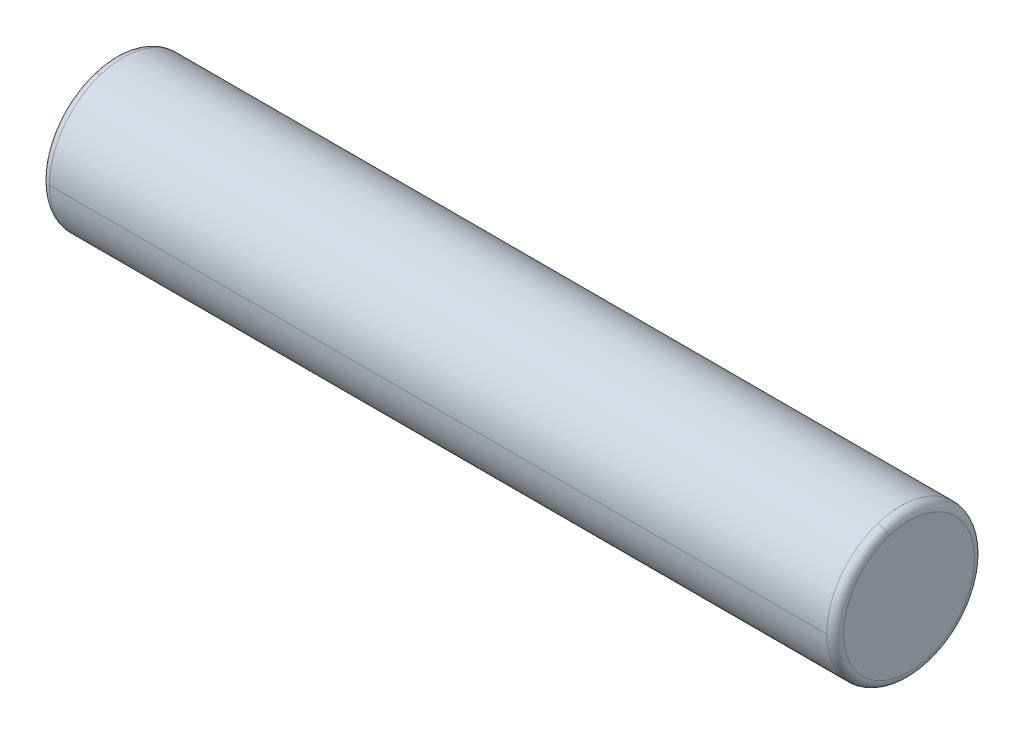
ISO-10303-21;
HEADER;
FILE_DESCRIPTION(('STEP AP214'),'2;1');
FILE_NAME('part.step','',(''),(''),'','','');
FILE_SCHEMA(('AUTOMOTIVE_DESIGN { 1 0 10303 214 1 1 1 1 }'));
ENDSEC;
DATA;
#1=APPLICATION_CONTEXT('core data for automotive mechanical design processes');
#2=APPLICATION_PROTOCOL_DEFINITION('international standard','automotive_design',2000,#1);
#3=PRODUCT_CONTEXT('',#1,'mechanical');
#4=PRODUCT('Part','Part','',(#3));
#5=PRODUCT_RELATED_PRODUCT_CATEGORY('part','',(#4));
#6=PRODUCT_DEFINITION_FORMATION('','',#4);
#7=PRODUCT_DEFINITION_CONTEXT('part definition',#1,'design');
#8=PRODUCT_DEFINITION('design','',#6,#7);
#9=PRODUCT_DEFINITION_SHAPE('','',#8);
#10=(LENGTH_UNIT() NAMED_UNIT(*) SI_UNIT(.MILLI.,.METRE.));
#11=(NAMED_UNIT(*) PLANE_ANGLE_UNIT() SI_UNIT($,.RADIAN.));
#12=(NAMED_UNIT(*) SI_UNIT($,.STERADIAN.) SOLID_ANGLE_UNIT());
#13=UNCERTAINTY_MEASURE_WITH_UNIT(LENGTH_MEASURE(1.E-05),#10,'distance_accuracy_value','');
#14=(GEOMETRIC_REPRESENTATION_CONTEXT(3) GLOBAL_UNCERTAINTY_ASSIGNED_CONTEXT((#13)) GLOBAL_UNIT_ASSIGNED_CONTEXT((#10,
#11,#12)) REPRESENTATION_CONTEXT('',''));
#15=CARTESIAN_POINT('',(0.,0.,0.));
#16=DIRECTION('',(0.,0.,1.));
#17=DIRECTION('',(1.,0.,0.));
#18=AXIS2_PLACEMENT_3D('',#15,#16,#17);
#19=CARTESIAN_POINT('',(3.1,29.25,0.));
#20=DIRECTION('',(1.,0.,0.));
#21=DIRECTION('',(0.,0.,-1.));
#22=AXIS2_PLACEMENT_3D('',#19,#20,#21);
#23=PLANE('',#22);
#24=CARTESIAN_POINT('',(3.1,30.724137600257,0.478976341281001));
#25=CARTESIAN_POINT('',(3.1,30.7163008719419,0.503097051966079));
#26=CARTESIAN_POINT('',(3.1,30.7078711460442,0.527025037923453));
#27=CARTESIAN_POINT('',(3.1,30.6898482176225,0.574438756045452));
#28=CARTESIAN_POINT('',(3.1,30.6802550150986,0.597924488210076));
#29=CARTESIAN_POINT('',(3.1,30.6599276519636,0.644396894409227));
#30=CARTESIAN_POINT('',(3.1,30.6491934913525,0.667383568443754));
#31=CARTESIAN_POINT('',(3.1,30.6266102302895,0.712802541800716));
#32=CARTESIAN_POINT('',(3.1,30.6147611298377,0.735234841123151));
#33=CARTESIAN_POINT('',(3.1,30.589976492087,0.779491007516879));
#34=CARTESIAN_POINT('',(3.1,30.5770409547882,0.801314874588172));
#35=CARTESIAN_POINT('',(3.1,30.550114617581,0.844301605203733));
#36=CARTESIAN_POINT('',(3.1,30.5361238176727,0.865464468748));
#37=CARTESIAN_POINT('',(3.1,30.5071206572556,0.907078207956979));
#38=CARTESIAN_POINT('',(3.1,30.4921082967468,0.92752908362169));
#39=CARTESIAN_POINT('',(3.1,30.4610981820384,0.967669579431778));
#40=CARTESIAN_POINT('',(3.1,30.4451004278388,0.987359199577156));
#41=CARTESIAN_POINT('',(3.1,30.4121580655205,1.02592975024571));
#42=CARTESIAN_POINT('',(3.1,30.3952134574019,1.04481068076889));
#43=CARTESIAN_POINT('',(3.1,30.3604182083495,1.08171836639997));
#44=CARTESIAN_POINT('',(3.1,30.3425675674158,1.09974512150787));
#45=CARTESIAN_POINT('',(3.1,30.306003256475,1.1349010282704));
#46=CARTESIAN_POINT('',(3.1,30.2872895864679,1.15203017992503));
#47=CARTESIAN_POINT('',(3.1,30.2490443002548,1.18534961415595));
#48=CARTESIAN_POINT('',(3.1,30.2295126840488,1.20153989673224));
#49=CARTESIAN_POINT('',(3.1,30.189678558811,1.23294258899722));
#50=CARTESIAN_POINT('',(3.1,30.1693760497791,1.24815499868591));
#51=CARTESIAN_POINT('',(3.1,30.1280490494124,1.27756529714842));
#52=CARTESIAN_POINT('',(3.1,30.1070245580776,1.29176318592224));
#53=CARTESIAN_POINT('',(3.1,30.0643042429459,1.31911023859733));
#54=CARTESIAN_POINT('',(3.1,30.0426084191492,1.33225940249861));
#55=CARTESIAN_POINT('',(3.1,29.9985977062335,1.35747732794104));
#56=CARTESIAN_POINT('',(3.1,29.9762828171147,1.36954608948221));
#57=CARTESIAN_POINT('',(3.1,29.9310877320774,1.39257413550077));
#58=CARTESIAN_POINT('',(3.1,29.908207536159,1.40353341997817));
#59=CARTESIAN_POINT('',(3.1,29.8619369579185,1.42431610999299));
#60=CARTESIAN_POINT('',(3.1,29.8385465755964,1.4341395155304));
#61=CARTESIAN_POINT('',(3.1,29.7913119740285,1.45262678222088));
#62=CARTESIAN_POINT('',(3.1,29.7674677547827,1.46129064337394));
#63=CARTESIAN_POINT('',(3.1,29.7193829221799,1.47743794929532));
#64=CARTESIAN_POINT('',(3.1,29.6951423088229,1.48492139406364));
#65=CARTESIAN_POINT('',(3.1,29.6463230857586,1.49868983894163));
#66=CARTESIAN_POINT('',(3.1,29.6217444760512,1.50497483905129));
#67=CARTESIAN_POINT('',(3.1,29.5723084723099,1.5163312534962));
#68=CARTESIAN_POINT('',(3.1,29.5474510782758,1.52140266783144));
#69=CARTESIAN_POINT('',(3.1,29.4975173895205,1.53031969324616));
#70=CARTESIAN_POINT('',(3.1,29.4724410947992,1.53416530432564));
#71=CARTESIAN_POINT('',(3.1,29.4221300156598,1.54062145881492));
#72=CARTESIAN_POINT('',(3.1,29.3968952312417,1.54323200222472));
#73=CARTESIAN_POINT('',(3.1,29.3463279655146,1.5472117323469));
#74=CARTESIAN_POINT('',(3.1,29.3209954842056,1.54858091905928));
#75=CARTESIAN_POINT('',(3.1,29.2702938528631,1.55007463729591));
#76=CARTESIAN_POINT('',(3.1,29.2449247028296,1.55019916882015));
#77=CARTESIAN_POINT('',(3.1,29.1942108505425,1.54920327667317));
#78=CARTESIAN_POINT('',(3.1,29.168866148289,1.54808285300193));
#79=CARTESIAN_POINT('',(3.1,29.1182622491695,1.54459974966274));
#80=CARTESIAN_POINT('',(3.1,29.0930030523037,1.54223706999478));
#81=CARTESIAN_POINT('',(3.1,29.0426310155772,1.53627514656442));
#82=CARTESIAN_POINT('',(3.1,29.0175181757166,1.532675902802));
#83=CARTESIAN_POINT('',(3.1,28.9674993520317,1.52424952207621));
#84=CARTESIAN_POINT('',(3.1,28.9425933682073,1.51942238511282));
#85=CARTESIAN_POINT('',(3.1,28.8930482572913,1.50855184698083));
#86=CARTESIAN_POINT('',(3.1,28.8684091301996,1.50250844581222));
#87=CARTESIAN_POINT('',(3.1,28.8194570905643,1.48921993835254));
#88=CARTESIAN_POINT('',(3.1,28.7951441780207,1.48197483206146));
#89=CARTESIAN_POINT('',(3.1,28.7469031394173,1.46630036845249));
#90=CARTESIAN_POINT('',(3.1,28.7229750133576,1.4578710111346));
#91=CARTESIAN_POINT('',(3.1,28.6755611926735,1.4398483525321));
#92=CARTESIAN_POINT('',(3.1,28.6520754980492,1.43025505124749));
#93=CARTESIAN_POINT('',(3.1,28.6056031193315,1.40992761581464));
#94=CARTESIAN_POINT('',(3.1,28.5826164352381,1.39919348166639));
#95=CARTESIAN_POINT('',(3.1,28.5371974545175,1.37661023997561));
#96=CARTESIAN_POINT('',(3.1,28.5147651578903,1.36476113243307));
#97=CARTESIAN_POINT('',(3.1,28.4705089934697,1.33997648949166));
#98=CARTESIAN_POINT('',(3.1,28.4486851256762,1.32704095409277));
#99=CARTESIAN_POINT('',(3.1,28.4056983945319,1.30011461827644));
#100=CARTESIAN_POINT('',(3.1,28.3845355311812,1.286123817859));
#101=CARTESIAN_POINT('',(3.1,28.3429217921139,1.25712065706921));
#102=CARTESIAN_POINT('',(3.1,28.3224709163973,1.24210829669686));
#103=CARTESIAN_POINT('',(3.1,28.2823304205492,1.21109818208833));
#104=CARTESIAN_POINT('',(3.1,28.2626408004178,1.19510042785215));
#105=CARTESIAN_POINT('',(3.1,28.2240702497594,1.16215806550713));
#106=CARTESIAN_POINT('',(3.1,28.2051893192325,1.1452134573983));
#107=CARTESIAN_POINT('',(3.1,28.1682816335987,1.1104182083531));
#108=CARTESIAN_POINT('',(3.1,28.1502548784918,1.09256756741673));
#109=CARTESIAN_POINT('',(3.1,28.11509897173,1.056003256474));
#110=CARTESIAN_POINT('',(3.1,28.0979698200751,1.03728958646764));
#111=CARTESIAN_POINT('',(3.1,28.064650385844,0.999044300255088));
#112=CARTESIAN_POINT('',(3.1,28.0484601032677,0.979512684048904));
#113=CARTESIAN_POINT('',(3.1,28.0170574110028,0.939678558810919));
#114=CARTESIAN_POINT('',(3.1,28.0018450013141,0.919376049779119));
#115=CARTESIAN_POINT('',(3.1,27.9724347028516,0.878049049412452));
#116=CARTESIAN_POINT('',(3.1,27.9582368140778,0.857024558077586));
#117=CARTESIAN_POINT('',(3.1,27.9308897614027,0.814304242945939));
#118=CARTESIAN_POINT('',(3.1,27.9177405975014,0.792608419149159));
#119=CARTESIAN_POINT('',(3.1,27.892522672059,0.748597706233541));
#120=CARTESIAN_POINT('',(3.1,27.8804539105178,0.726282817114703));
#121=CARTESIAN_POINT('',(3.1,27.8574258644992,0.68108773207741));
#122=CARTESIAN_POINT('',(3.1,27.8464665800218,0.658207536158955));
#123=CARTESIAN_POINT('',(3.1,27.825683890007,0.611936957918464));
#124=CARTESIAN_POINT('',(3.1,27.8158604844696,0.588546575596428));
#125=CARTESIAN_POINT('',(3.1,27.7973732177791,0.541311974028549));
#126=CARTESIAN_POINT('',(3.1,27.7887093566261,0.517467754782707));
#127=CARTESIAN_POINT('',(3.1,27.7725620507047,0.469382922179862));
#128=CARTESIAN_POINT('',(3.1,27.7650786059363,0.44514230882286));
#129=CARTESIAN_POINT('',(3.1,27.7513101610584,0.396323085758586));
#130=CARTESIAN_POINT('',(3.1,27.745025160949,0.371744476051314));
#131=CARTESIAN_POINT('',(3.1,27.7336687465035,0.322308472309799));
#132=CARTESIAN_POINT('',(3.1,27.7285973321676,0.297451078275557));
#133=CARTESIAN_POINT('',(3.1,27.7196803067548,0.247517389520762));
#134=CARTESIAN_POINT('',(3.1,27.7158346956781,0.222441094800211));
#135=CARTESIAN_POINT('',(3.1,27.7093785411814,0.172130015658794));
#136=CARTESIAN_POINT('',(3.1,27.7067679977615,0.146895231237927));
#137=CARTESIAN_POINT('',(3.1,27.7027882676669,0.0963279655183182));
#138=CARTESIAN_POINT('',(3.1,27.7014190809923,0.0709954842195761));
#139=CARTESIAN_POINT('',(3.1,27.6999253626525,0.0202938528490886));
#140=CARTESIAN_POINT('',(3.1,27.6998008309875,-0.00507529722265686));
#141=CARTESIAN_POINT('',(3.1,27.7007967235192,-0.0557891494052583));
#142=CARTESIAN_POINT('',(3.1,27.7019171477161,-0.0811338515161143));
#143=CARTESIAN_POINT('',(3.1,27.7054002496193,-0.131737751025358));
#144=CARTESIAN_POINT('',(3.1,27.7077629273256,-0.156996948423746));
#145=CARTESIAN_POINT('',(3.1,27.7137248561152,-0.207368983695411));
#146=CARTESIAN_POINT('',(3.1,27.7173241071983,-0.232481821568688));
#147=CARTESIAN_POINT('',(3.1,27.7257504679235,-0.282500650682992));
#148=CARTESIAN_POINT('',(3.1,27.7305775775655,-0.30740664192402));
#149=CARTESIAN_POINT('',(3.1,27.7414481903408,-0.356951732577393));
#150=CARTESIAN_POINT('',(3.1,27.7474916934742,-0.381590831989738));
#151=CARTESIAN_POINT('',(3.1,27.7607799223611,-0.430542947246312));
#152=CARTESIAN_POINT('',(3.1,27.7680246481147,-0.454855963090541));
#153=CARTESIAN_POINT('',(3.1,27.775862399743,-0.478976341280996));
#154=B_SPLINE_CURVE_WITH_KNOTS('',3,(#24,#25,#26,#27,#28,#29,#30,#31,#32,#33,#34,#35,#36,#37,
#38,#39,#40,#41,#42,#43,#44,#45,#46,#47,#48,#49,#50,#51,#52,#53,#54,#55,#56,#57,#58,#59,#60,#61,
#62,#63,#64,#65,#66,#67,#68,#69,#70,#71,#72,#73,#74,#75,#76,#77,#78,#79,#80,#81,#82,#83,#84,#85,
#86,#87,#88,#89,#90,#91,#92,#93,#94,#95,#96,#97,#98,#99,#100,#101,#102,#103,#104,#105,#106,#107,
#108,#109,#110,#111,#112,#113,#114,#115,#116,#117,#118,#119,#120,#121,#122,#123,#124,#125,#126,
#127,#128,#129,#130,#131,#132,#133,#134,#135,#136,#137,#138,#139,#140,#141,#142,#143,#144,#145,
#146,#147,#148,#149,#150,#151,#152,#153),.UNSPECIFIED.,.F.,.F.,(4,2,2,2,2,2,2,2,2,2,2,2,2,2,2,2,
2,2,2,2,2,2,2,2,2,2,2,2,2,2,2,2,2,2,2,2,2,2,2,2,2,2,2,2,2,2,2,2,2,2,2,2,2,2,2,2,2,2,2,2,2,2,2,2,
4),(0.,0.0760778084210016,0.152155616842003,0.228233425263003,0.304311233684006,
0.380389042105006,0.456466850526008,0.53254465894701,0.608622467368011,0.684700275789012,
0.760778084210015,0.836855892631017,0.912933701052018,0.989011509473018,1.06508931789402,
1.14116712631502,1.21724493473602,1.29332274315702,1.36940055157803,1.44547835999903,
1.52155616842003,1.59763397684103,1.67371178526203,1.74978959368303,1.82586740210404,
1.90194521052504,1.97802301894604,2.05410082736704,2.13017863578804,2.20625644420904,
2.28233425263004,2.35841206105104,2.43448986947205,2.51056767789305,2.58664548631405,
2.66272329473505,2.73880110315605,2.81487891157705,2.89095671999805,2.96703452841906,
3.04311233684006,3.11919014526106,3.19526795368206,3.27134576210306,3.34742357052406,
3.42350137894507,3.49957918736607,3.57565699578707,3.65173480420807,3.72781261262907,
3.80389042105007,3.87996822947107,3.95604603789208,4.03212384631308,4.10820165473408,
4.18427946315508,4.26035727157608,4.33643507999708,4.41251288841808,4.48859069683909,
4.56466850526009,4.64074631368109,4.71682412210209,4.79290193052309,4.86897973894409),.UNSPECIFIED.);
#155=CARTESIAN_POINT('',(3.1,30.724137600257,0.478976341281001));
#156=VERTEX_POINT('',#155);
#157=CARTESIAN_POINT('',(3.1,27.775862399743,-0.478976341281001));
#158=VERTEX_POINT('',#157);
#159=EDGE_CURVE('E11',#156,#158,#154,.T.);
#160=ORIENTED_EDGE('',*,*,#159,.F.);
#161=CARTESIAN_POINT('',(3.1,27.775862399743,-0.478976341281001));
#162=CARTESIAN_POINT('',(3.1,27.7836991280581,-0.503097051966078));
#163=CARTESIAN_POINT('',(3.1,27.7921288539558,-0.527025037923453));
#164=CARTESIAN_POINT('',(3.1,27.8101517823775,-0.574438756045452));
#165=CARTESIAN_POINT('',(3.1,27.8197449849014,-0.597924488210076));
#166=CARTESIAN_POINT('',(3.1,27.8400723480365,-0.644396894409227));
#167=CARTESIAN_POINT('',(3.1,27.8508065086475,-0.667383568443754));
#168=CARTESIAN_POINT('',(3.1,27.8733897697105,-0.712802541800716));
#169=CARTESIAN_POINT('',(3.1,27.8852388701623,-0.735234841123151));
#170=CARTESIAN_POINT('',(3.1,27.910023507913,-0.779491007516879));
#171=CARTESIAN_POINT('',(3.1,27.9229590452118,-0.801314874588172));
#172=CARTESIAN_POINT('',(3.1,27.949885382419,-0.844301605203732));
#173=CARTESIAN_POINT('',(3.1,27.9638761823273,-0.865464468748));
#174=CARTESIAN_POINT('',(3.1,27.9928793427445,-0.907078207956979));
#175=CARTESIAN_POINT('',(3.1,28.0078917032532,-0.92752908362169));
#176=CARTESIAN_POINT('',(3.1,28.0389018179616,-0.967669579431778));
#177=CARTESIAN_POINT('',(3.1,28.0548995721612,-0.987359199577155));
#178=CARTESIAN_POINT('',(3.1,28.0878419344795,-1.02592975024571));
#179=CARTESIAN_POINT('',(3.1,28.1047865425981,-1.04481068076889));
#180=CARTESIAN_POINT('',(3.1,28.1395817916505,-1.08171836639997));
#181=CARTESIAN_POINT('',(3.1,28.1574324325842,-1.09974512150787));
#182=CARTESIAN_POINT('',(3.1,28.193996743525,-1.1349010282704));
#183=CARTESIAN_POINT('',(3.1,28.2127104135321,-1.15203017992503));
#184=CARTESIAN_POINT('',(3.1,28.2509556997452,-1.18534961415595));
#185=CARTESIAN_POINT('',(3.1,28.2704873159512,-1.20153989673224));
#186=CARTESIAN_POINT('',(3.1,28.310321441189,-1.23294258899722));
#187=CARTESIAN_POINT('',(3.1,28.3306239502209,-1.24815499868591));
#188=CARTESIAN_POINT('',(3.1,28.3719509505876,-1.27756529714842));
#189=CARTESIAN_POINT('',(3.1,28.3929754419224,-1.29176318592224));
#190=CARTESIAN_POINT('',(3.1,28.4356957570541,-1.31911023859733));
#191=CARTESIAN_POINT('',(3.1,28.4573915808508,-1.33225940249861));
#192=CARTESIAN_POINT('',(3.1,28.5014022937665,-1.35747732794104));
#193=CARTESIAN_POINT('',(3.1,28.5237171828853,-1.3695460894822));
#194=CARTESIAN_POINT('',(3.1,28.5689122679226,-1.39257413550077));
#195=CARTESIAN_POINT('',(3.1,28.591792463841,-1.40353341997817));
#196=CARTESIAN_POINT('',(3.1,28.6380630420815,-1.42431610999299));
#197=CARTESIAN_POINT('',(3.1,28.6614534244036,-1.4341395155304));
#198=CARTESIAN_POINT('',(3.1,28.7086880259715,-1.45262678222088));
#199=CARTESIAN_POINT('',(3.1,28.7325322452173,-1.46129064337394));
#200=CARTESIAN_POINT('',(3.1,28.7806170778201,-1.47743794929532));
#201=CARTESIAN_POINT('',(3.1,28.8048576911771,-1.48492139406364));
#202=CARTESIAN_POINT('',(3.1,28.8536769142414,-1.49868983894162));
#203=CARTESIAN_POINT('',(3.1,28.8782555239488,-1.50497483905129));
#204=CARTESIAN_POINT('',(3.1,28.9276915276901,-1.5163312534962));
#205=CARTESIAN_POINT('',(3.1,28.9525489217242,-1.52140266783144));
#206=CARTESIAN_POINT('',(3.1,29.0024826104795,-1.53031969324616));
#207=CARTESIAN_POINT('',(3.1,29.0275589052008,-1.53416530432564));
#208=CARTESIAN_POINT('',(3.1,29.0778699843402,-1.54062145881492));
#209=CARTESIAN_POINT('',(3.1,29.1031047687583,-1.54323200222472));
#210=CARTESIAN_POINT('',(3.1,29.1536720344854,-1.5472117323469));
#211=CARTESIAN_POINT('',(3.1,29.1790045157944,-1.54858091905928));
#212=CARTESIAN_POINT('',(3.1,29.2297061471369,-1.55007463729591));
#213=CARTESIAN_POINT('',(3.1,29.2550752971704,-1.55019916882015));
#214=CARTESIAN_POINT('',(3.1,29.3057891494575,-1.54920327667317));
#215=CARTESIAN_POINT('',(3.1,29.331133851711,-1.54808285300193));
#216=CARTESIAN_POINT('',(3.1,29.3817377508305,-1.54459974966274));
#217=CARTESIAN_POINT('',(3.1,29.4069969476964,-1.54223706999478));
#218=CARTESIAN_POINT('',(3.1,29.4573689844228,-1.53627514656442));
#219=CARTESIAN_POINT('',(3.1,29.4824818242834,-1.532675902802));
#220=CARTESIAN_POINT('',(3.1,29.5325006479683,-1.52424952207621));
#221=CARTESIAN_POINT('',(3.1,29.5574066317927,-1.51942238511282));
#222=CARTESIAN_POINT('',(3.1,29.6069517427087,-1.50855184698083));
#223=CARTESIAN_POINT('',(3.1,29.6315908698004,-1.50250844581222));
#224=CARTESIAN_POINT('',(3.1,29.6805429094357,-1.48921993835254));
#225=CARTESIAN_POINT('',(3.1,29.7048558219793,-1.48197483206146));
#226=CARTESIAN_POINT('',(3.1,29.7530968605827,-1.46630036845249));
#227=CARTESIAN_POINT('',(3.1,29.7770249866424,-1.4578710111346));
#228=CARTESIAN_POINT('',(3.1,29.8244388073265,-1.4398483525321));
#229=CARTESIAN_POINT('',(3.1,29.8479245019508,-1.43025505124749));
#230=CARTESIAN_POINT('',(3.1,29.8943968806685,-1.40992761581464));
#231=CARTESIAN_POINT('',(3.1,29.9173835647619,-1.39919348166639));
#232=CARTESIAN_POINT('',(3.1,29.9628025454825,-1.37661023997561));
#233=CARTESIAN_POINT('',(3.1,29.9852348421097,-1.36476113243307));
#234=CARTESIAN_POINT('',(3.1,30.0294910065303,-1.33997648949166));
#235=CARTESIAN_POINT('',(3.1,30.0513148743238,-1.32704095409277));
#236=CARTESIAN_POINT('',(3.1,30.0943016054681,-1.30011461827644));
#237=CARTESIAN_POINT('',(3.1,30.1154644688188,-1.286123817859));
#238=CARTESIAN_POINT('',(3.1,30.1570782078861,-1.25712065706921));
#239=CARTESIAN_POINT('',(3.1,30.1775290836027,-1.24210829669686));
#240=CARTESIAN_POINT('',(3.1,30.2176695794508,-1.21109818208833));
#241=CARTESIAN_POINT('',(3.1,30.2373591995822,-1.19510042785215));
#242=CARTESIAN_POINT('',(3.1,30.2759297502406,-1.16215806550713));
#243=CARTESIAN_POINT('',(3.1,30.2948106807675,-1.1452134573983));
#244=CARTESIAN_POINT('',(3.1,30.3317183664013,-1.1104182083531));
#245=CARTESIAN_POINT('',(3.1,30.3497451215082,-1.09256756741673));
#246=CARTESIAN_POINT('',(3.1,30.38490102827,-1.056003256474));
#247=CARTESIAN_POINT('',(3.1,30.4020301799249,-1.03728958646764));
#248=CARTESIAN_POINT('',(3.1,30.435349614156,-0.99904430025509));
#249=CARTESIAN_POINT('',(3.1,30.4515398967323,-0.979512684048905));
#250=CARTESIAN_POINT('',(3.1,30.4829425889972,-0.93967855881092));
#251=CARTESIAN_POINT('',(3.1,30.4981549986859,-0.919376049779121));
#252=CARTESIAN_POINT('',(3.1,30.5275652971484,-0.878049049412455));
#253=CARTESIAN_POINT('',(3.1,30.5417631859222,-0.857024558077588));
#254=CARTESIAN_POINT('',(3.1,30.5691102385973,-0.814304242945941));
#255=CARTESIAN_POINT('',(3.1,30.5822594024986,-0.792608419149161));
#256=CARTESIAN_POINT('',(3.1,30.607477327941,-0.748597706233543));
#257=CARTESIAN_POINT('',(3.1,30.6195460894822,-0.726282817114704));
#258=CARTESIAN_POINT('',(3.1,30.6425741355008,-0.681087732077411));
#259=CARTESIAN_POINT('',(3.1,30.6535334199782,-0.658207536158957));
#260=CARTESIAN_POINT('',(3.1,30.674316109993,-0.611936957918467));
#261=CARTESIAN_POINT('',(3.1,30.6841395155304,-0.58854657559643));
#262=CARTESIAN_POINT('',(3.1,30.7026267822209,-0.541311974028552));
#263=CARTESIAN_POINT('',(3.1,30.7112906433739,-0.517467754782709));
#264=CARTESIAN_POINT('',(3.1,30.7274379492953,-0.469382922179864));
#265=CARTESIAN_POINT('',(3.1,30.7349213940637,-0.445142308822862));
#266=CARTESIAN_POINT('',(3.1,30.7486898389416,-0.396323085758588));
#267=CARTESIAN_POINT('',(3.1,30.754974839051,-0.371744476051316));
#268=CARTESIAN_POINT('',(3.1,30.7663312534965,-0.322308472309802));
#269=CARTESIAN_POINT('',(3.1,30.7714026678324,-0.297451078275559));
#270=CARTESIAN_POINT('',(3.1,30.7803196932452,-0.247517389520765));
#271=CARTESIAN_POINT('',(3.1,30.7841653043219,-0.222441094800213));
#272=CARTESIAN_POINT('',(3.1,30.7906214588186,-0.172130015658796));
#273=CARTESIAN_POINT('',(3.1,30.7932320022385,-0.146895231237929));
#274=CARTESIAN_POINT('',(3.1,30.7972117323331,-0.0963279655183212));
#275=CARTESIAN_POINT('',(3.1,30.7985809190077,-0.0709954842195791));
#276=CARTESIAN_POINT('',(3.1,30.8000746373475,-0.0202938528490916));
#277=CARTESIAN_POINT('',(3.1,30.8001991690125,0.00507529722265386));
#278=CARTESIAN_POINT('',(3.1,30.7992032764808,0.0557891494052553));
#279=CARTESIAN_POINT('',(3.1,30.7980828522839,0.0811338515161114));
#280=CARTESIAN_POINT('',(3.1,30.7945997503807,0.131737751025355));
#281=CARTESIAN_POINT('',(3.1,30.7922370726744,0.156996948423743));
#282=CARTESIAN_POINT('',(3.1,30.7862751438848,0.207368983695409));
#283=CARTESIAN_POINT('',(3.1,30.7826758928017,0.232481821568686));
#284=CARTESIAN_POINT('',(3.1,30.7742495320765,0.282500650682991));
#285=CARTESIAN_POINT('',(3.1,30.7694224224345,0.307406641924018));
#286=CARTESIAN_POINT('',(3.1,30.7585518096592,0.356951732577391));
#287=CARTESIAN_POINT('',(3.1,30.7525083065258,0.381590831989736));
#288=CARTESIAN_POINT('',(3.1,30.7392200776389,0.43054294724631));
#289=CARTESIAN_POINT('',(3.1,30.7319753518853,0.454855963090539));
#290=CARTESIAN_POINT('',(3.1,30.724137600257,0.478976341280993));
#291=B_SPLINE_CURVE_WITH_KNOTS('',3,(#161,#162,#163,#164,#165,#166,#167,#168,#169,#170,#171,
#172,#173,#174,#175,#176,#177,#178,#179,#180,#181,#182,#183,#184,#185,#186,#187,#188,#189,#190,
#191,#192,#193,#194,#195,#196,#197,#198,#199,#200,#201,#202,#203,#204,#205,#206,#207,#208,#209,
#210,#211,#212,#213,#214,#215,#216,#217,#218,#219,#220,#221,#222,#223,#224,#225,#226,#227,#228,
#229,#230,#231,#232,#233,#234,#235,#236,#237,#238,#239,#240,#241,#242,#243,#244,#245,#246,#247,
#248,#249,#250,#251,#252,#253,#254,#255,#256,#257,#258,#259,#260,#261,#262,#263,#264,#265,#266,
#267,#268,#269,#270,#271,#272,#273,#274,#275,#276,#277,#278,#279,#280,#281,#282,#283,#284,#285,
#286,#287,#288,#289,#290),.UNSPECIFIED.,.F.,.F.,(4,2,2,2,2,2,2,2,2,2,2,2,2,2,2,2,2,2,2,2,2,2,2,
2,2,2,2,2,2,2,2,2,2,2,2,2,2,2,2,2,2,2,2,2,2,2,2,2,2,2,2,2,2,2,2,2,2,2,2,2,2,2,2,2,4),(0.,
0.0760778084210017,0.152155616842002,0.228233425263003,0.304311233684006,0.380389042105006,
0.456466850526008,0.53254465894701,0.60862246736801,0.684700275789012,0.760778084210015,
0.836855892631014,0.912933701052015,0.989011509473018,1.06508931789402,1.14116712631502,
1.21724493473602,1.29332274315702,1.36940055157803,1.44547835999903,1.52155616842003,
1.59763397684103,1.67371178526203,1.74978959368303,1.82586740210403,1.90194521052504,
1.97802301894604,2.05410082736704,2.13017863578804,2.20625644420904,2.28233425263004,
2.35841206105105,2.43448986947204,2.51056767789305,2.58664548631405,2.66272329473505,
2.73880110315605,2.81487891157705,2.89095671999806,2.96703452841906,3.04311233684006,
3.11919014526106,3.19526795368206,3.27134576210306,3.34742357052406,3.42350137894507,
3.49957918736607,3.57565699578707,3.65173480420807,3.72781261262907,3.80389042105007,
3.87996822947107,3.95604603789207,4.03212384631308,4.10820165473408,4.18427946315508,
4.26035727157608,4.33643507999708,4.41251288841808,4.48859069683908,4.56466850526008,
4.64074631368109,4.71682412210209,4.79290193052309,4.86897973894409),.UNSPECIFIED.);
#292=EDGE_CURVE('E26',#158,#156,#291,.T.);
#293=ORIENTED_EDGE('',*,*,#292,.F.);
#294=EDGE_LOOP('',(#160,#293));
#295=FACE_BOUND('',#294,.T.);
#296=ADVANCED_FACE('F16',(#295),#23,.F.);
#297=CARTESIAN_POINT('',(3.30000000000054,29.25,0.));
#298=DIRECTION('',(1.,0.,0.));
#299=DIRECTION('',(0.,-0.309016994374947,0.951056516295154));
#300=AXIS2_PLACEMENT_3D('',#297,#298,#299);
#301=TOROIDAL_SURFACE('',#300,1.54999999999946,0.200000000000541);
#302=CARTESIAN_POINT('',(3.30000000000054,27.775862399743,-0.478976341281001));
#303=DIRECTION('',(0.,0.309016994374946,-0.951056516295154));
#304=DIRECTION('',(-2.70228284193032E-12,-0.951056516295154,-0.309016994374946));
#305=AXIS2_PLACEMENT_3D('',#302,#303,#304);
#306=CIRCLE('',#305,0.200000000000541);
#307=CARTESIAN_POINT('',(3.3,27.5856510964835,-0.540779740156158));
#308=VERTEX_POINT('',#307);
#309=EDGE_CURVE('E167',#308,#158,#306,.T.);
#310=ORIENTED_EDGE('',*,*,#309,.T.);
#311=ORIENTED_EDGE('',*,*,#292,.T.);
#312=CARTESIAN_POINT('',(3.30000000000054,30.724137600257,0.478976341281002));
#313=DIRECTION('',(0.,-0.309016994374946,0.951056516295154));
#314=DIRECTION('',(-2.70228284193032E-12,0.951056516295154,0.309016994374946));
#315=AXIS2_PLACEMENT_3D('',#312,#313,#314);
#316=CIRCLE('',#315,0.200000000000541);
#317=CARTESIAN_POINT('',(3.3,30.9143489035165,0.540779740156158));
#318=VERTEX_POINT('',#317);
#319=EDGE_CURVE('E162',#318,#156,#316,.T.);
#320=ORIENTED_EDGE('',*,*,#319,.F.);
#321=CARTESIAN_POINT('',(3.3,29.25,0.));
#322=DIRECTION('',(1.,0.,0.));
#323=DIRECTION('',(0.,0.,-1.));
#324=AXIS2_PLACEMENT_3D('',#321,#322,#323);
#325=CIRCLE('',#324,1.75);
#326=CARTESIAN_POINT('',(3.3,29.25,-1.75));
#327=VERTEX_POINT('',#326);
#328=EDGE_CURVE('E156',#327,#318,#325,.T.);
#329=ORIENTED_EDGE('',*,*,#328,.F.);
#330=CARTESIAN_POINT('',(3.3,29.25,0.));
#331=DIRECTION('',(1.,0.,0.));
#332=DIRECTION('',(0.,0.,-1.));
#333=AXIS2_PLACEMENT_3D('',#330,#331,#332);
#334=CIRCLE('',#333,1.75);
#335=EDGE_CURVE('E150',#308,#327,#334,.T.);
#336=ORIENTED_EDGE('',*,*,#335,.F.);
#337=EDGE_LOOP('',(#310,#311,#320,#329,#336));
#338=FACE_BOUND('',#337,.T.);
#339=ADVANCED_FACE('F174',(#338),#301,.T.);
#340=CARTESIAN_POINT('',(21.9,29.25,0.));
#341=DIRECTION('',(1.,0.,0.));
#342=DIRECTION('',(0.,1.,0.));
#343=AXIS2_PLACEMENT_3D('',#340,#341,#342);
#344=CYLINDRICAL_SURFACE('',#343,1.75);
#345=DIRECTION('',(1.,0.,0.));
#346=VECTOR('',#345,1.);
#347=CARTESIAN_POINT('',(3.3,29.25,1.75));
#348=LINE('',#347,#346);
#349=CARTESIAN_POINT('',(3.3,29.25,1.75));
#350=VERTEX_POINT('',#349);
#351=CARTESIAN_POINT('',(21.7,29.25,1.75));
#352=VERTEX_POINT('',#351);
#353=EDGE_CURVE('E107',#350,#352,#348,.T.);
#354=ORIENTED_EDGE('',*,*,#353,.F.);
#355=CARTESIAN_POINT('',(3.3,29.25,0.));
#356=DIRECTION('',(1.,0.,0.));
#357=DIRECTION('',(0.,0.,-1.));
#358=AXIS2_PLACEMENT_3D('',#355,#356,#357);
#359=CIRCLE('',#358,1.75);
#360=EDGE_CURVE('E140',#350,#308,#359,.T.);
#361=ORIENTED_EDGE('',*,*,#360,.T.);
#362=ORIENTED_EDGE('',*,*,#335,.T.);
#363=DIRECTION('',(1.,0.,0.));
#364=VECTOR('',#363,1.);
#365=CARTESIAN_POINT('',(3.3,29.25,-1.75));
#366=LINE('',#365,#364);
#367=CARTESIAN_POINT('',(21.7,29.25,-1.75));
#368=VERTEX_POINT('',#367);
#369=EDGE_CURVE('E135',#327,#368,#366,.T.);
#370=ORIENTED_EDGE('',*,*,#369,.T.);
#371=CARTESIAN_POINT('',(21.7,29.25,0.));
#372=DIRECTION('',(1.,0.,0.));
#373=DIRECTION('',(0.,0.,-1.));
#374=AXIS2_PLACEMENT_3D('',#371,#372,#373);
#375=CIRCLE('',#374,1.75);
#376=CARTESIAN_POINT('',(21.7,27.5856510964835,-0.540779740156158));
#377=VERTEX_POINT('',#376);
#378=EDGE_CURVE('E98',#377,#368,#375,.T.);
#379=ORIENTED_EDGE('',*,*,#378,.F.);
#380=CARTESIAN_POINT('',(21.7,29.25,0.));
#381=DIRECTION('',(1.,0.,0.));
#382=DIRECTION('',(0.,0.,-1.));
#383=AXIS2_PLACEMENT_3D('',#380,#381,#382);
#384=CIRCLE('',#383,1.75);
#385=EDGE_CURVE('E126',#352,#377,#384,.T.);
#386=ORIENTED_EDGE('',*,*,#385,.F.);
#387=EDGE_LOOP('',(#354,#361,#362,#370,#379,#386));
#388=FACE_BOUND('',#387,.T.);
#389=ADVANCED_FACE('F183',(#388),#344,.T.);
#390=CARTESIAN_POINT('',(21.6999999999989,29.25,0.));
#391=DIRECTION('',(1.,0.,0.));
#392=DIRECTION('',(0.,0.309016994374947,-0.951056516295154));
#393=AXIS2_PLACEMENT_3D('',#390,#391,#392);
#394=TOROIDAL_SURFACE('',#393,1.54999999999895,0.20000000000105);
#395=CARTESIAN_POINT('',(21.6999999999989,27.7758623997435,-0.478976341280844));
#396=DIRECTION('',(0.,0.309016994374947,-0.951056516295154));
#397=DIRECTION('',(1.,0.,0.));
#398=AXIS2_PLACEMENT_3D('',#395,#396,#397);
#399=CIRCLE('',#398,0.200000000001051);
#400=CARTESIAN_POINT('',(21.9,27.7758623997435,-0.478976341280844));
#401=VERTEX_POINT('',#400);
#402=EDGE_CURVE('E121',#401,#377,#399,.T.);
#403=ORIENTED_EDGE('',*,*,#402,.F.);
#404=CARTESIAN_POINT('',(21.9,29.25,0.));
#405=DIRECTION('',(1.,0.,0.));
#406=DIRECTION('',(0.,0.,-1.));
#407=AXIS2_PLACEMENT_3D('',#404,#405,#406);
#408=CIRCLE('',#407,1.55);
#409=CARTESIAN_POINT('',(21.9,30.7241376002565,0.478976341280844));
#410=VERTEX_POINT('',#409);
#411=EDGE_CURVE('E87',#410,#401,#408,.T.);
#412=ORIENTED_EDGE('',*,*,#411,.F.);
#413=CARTESIAN_POINT('',(21.6999999999989,30.7241376002565,0.478976341280844));
#414=DIRECTION('',(0.,-0.309016994374947,0.951056516295154));
#415=DIRECTION('',(1.,0.,0.));
#416=AXIS2_PLACEMENT_3D('',#413,#414,#415);
#417=CIRCLE('',#416,0.200000000001051);
#418=CARTESIAN_POINT('',(21.7,30.9143489035165,0.540779740156158));
#419=VERTEX_POINT('',#418);
#420=EDGE_CURVE('E80',#410,#419,#417,.T.);
#421=ORIENTED_EDGE('',*,*,#420,.T.);
#422=CARTESIAN_POINT('',(21.7,29.25,0.));
#423=DIRECTION('',(1.,0.,0.));
#424=DIRECTION('',(0.,0.,-1.));
#425=AXIS2_PLACEMENT_3D('',#422,#423,#424);
#426=CIRCLE('',#425,1.75);
#427=EDGE_CURVE('E85',#419,#352,#426,.T.);
#428=ORIENTED_EDGE('',*,*,#427,.T.);
#429=ORIENTED_EDGE('',*,*,#385,.T.);
#430=EDGE_LOOP('',(#403,#412,#421,#428,#429));
#431=FACE_BOUND('',#430,.T.);
#432=ADVANCED_FACE('F82',(#431),#394,.T.);
#433=CARTESIAN_POINT('',(21.9,29.25,0.));
#434=DIRECTION('',(1.,0.,0.));
#435=DIRECTION('',(0.,-1.,0.));
#436=AXIS2_PLACEMENT_3D('',#433,#434,#435);
#437=CYLINDRICAL_SURFACE('',#436,1.75);
#438=ORIENTED_EDGE('',*,*,#353,.T.);
#439=ORIENTED_EDGE('',*,*,#427,.F.);
#440=CARTESIAN_POINT('',(21.7,29.25,0.));
#441=DIRECTION('',(1.,0.,0.));
#442=DIRECTION('',(0.,0.,-1.));
#443=AXIS2_PLACEMENT_3D('',#440,#441,#442);
#444=CIRCLE('',#443,1.75);
#445=EDGE_CURVE('E95',#368,#419,#444,.T.);
#446=ORIENTED_EDGE('',*,*,#445,.F.);
#447=ORIENTED_EDGE('',*,*,#369,.F.);
#448=ORIENTED_EDGE('',*,*,#328,.T.);
#449=CARTESIAN_POINT('',(3.3,29.25,0.));
#450=DIRECTION('',(1.,0.,0.));
#451=DIRECTION('',(0.,0.,-1.));
#452=AXIS2_PLACEMENT_3D('',#449,#450,#451);
#453=CIRCLE('',#452,1.75);
#454=EDGE_CURVE('E102',#318,#350,#453,.T.);
#455=ORIENTED_EDGE('',*,*,#454,.T.);
#456=EDGE_LOOP('',(#438,#439,#446,#447,#448,#455));
#457=FACE_BOUND('',#456,.T.);
#458=ADVANCED_FACE('F105',(#457),#437,.T.);
#459=CARTESIAN_POINT('',(3.30000000000054,29.25,0.));
#460=DIRECTION('',(1.,0.,0.));
#461=DIRECTION('',(0.,0.309016994374947,-0.951056516295154));
#462=AXIS2_PLACEMENT_3D('',#459,#460,#461);
#463=TOROIDAL_SURFACE('',#462,1.54999999999946,0.200000000000541);
#464=ORIENTED_EDGE('',*,*,#309,.F.);
#465=ORIENTED_EDGE('',*,*,#360,.F.);
#466=ORIENTED_EDGE('',*,*,#454,.F.);
#467=ORIENTED_EDGE('',*,*,#319,.T.);
#468=ORIENTED_EDGE('',*,*,#159,.T.);
#469=EDGE_LOOP('',(#464,#465,#466,#467,#468));
#470=FACE_BOUND('',#469,.T.);
#471=ADVANCED_FACE('F192',(#470),#463,.T.);
#472=CARTESIAN_POINT('',(21.6999999999989,29.25,0.));
#473=DIRECTION('',(1.,0.,0.));
#474=DIRECTION('',(0.,-0.309016994374947,0.951056516295154));
#475=AXIS2_PLACEMENT_3D('',#472,#473,#474);
#476=TOROIDAL_SURFACE('',#475,1.54999999999895,0.20000000000105);
#477=ORIENTED_EDGE('',*,*,#402,.T.);
#478=ORIENTED_EDGE('',*,*,#378,.T.);
#479=ORIENTED_EDGE('',*,*,#445,.T.);
#480=ORIENTED_EDGE('',*,*,#420,.F.);
#481=CARTESIAN_POINT('',(21.9,27.7758623997425,-0.478976341281168));
#482=CARTESIAN_POINT('',(21.9,27.9264782974249,-0.941884387721592));
#483=CARTESIAN_POINT('',(21.9,28.2580658231372,-1.34696942542323));
#484=CARTESIAN_POINT('',(21.9,28.7436053927599,-1.59373420905432));
#485=CARTESIAN_POINT('',(21.9,29.7879223325458,-1.65555470715509));
#486=CARTESIAN_POINT('',(21.9,30.5964553072732,-0.991706777665464));
#487=CARTESIAN_POINT('',(21.9,30.844220369936,-0.506676875666024));
#488=CARTESIAN_POINT('',(21.9,30.8743773022746,0.0159460614594268));
#489=CARTESIAN_POINT('',(21.9,30.7241376002575,0.478976341281168));
#490=B_SPLINE_CURVE_WITH_KNOTS('',5,(#481,#482,#483,#484,#485,#486,#487,#488,#489),
.UNSPECIFIED.,.F.,.F.,(6,3,6),(0.,1.5707963267949,3.14159265358979),.UNSPECIFIED.);
#491=EDGE_CURVE('E214',#401,#410,#490,.T.);
#492=ORIENTED_EDGE('',*,*,#491,.F.);
#493=EDGE_LOOP('',(#477,#478,#479,#480,#492));
#494=FACE_BOUND('',#493,.T.);
#495=ADVANCED_FACE('F97',(#494),#476,.T.);
#496=CARTESIAN_POINT('',(21.9,30.8,0.));
#497=DIRECTION('',(-1.,0.,0.));
#498=DIRECTION('',(0.,0.,1.));
#499=AXIS2_PLACEMENT_3D('',#496,#497,#498);
#500=PLANE('',#499);
#501=ORIENTED_EDGE('',*,*,#491,.T.);
#502=ORIENTED_EDGE('',*,*,#411,.T.);
#503=EDGE_LOOP('',(#501,#502));
#504=FACE_BOUND('',#503,.T.);
#505=ADVANCED_FACE('F221',(#504),#500,.F.);
#506=CLOSED_SHELL('',(#296,#339,#389,#432,#458,#471,#495,#505));
#507=MANIFOLD_SOLID_BREP('B1',#506);
#508=ADVANCED_BREP_SHAPE_REPRESENTATION('',(#18,#507),#14);
#509=SHAPE_DEFINITION_REPRESENTATION(#9,#508);
ENDSEC;
END-ISO-10303-21;
